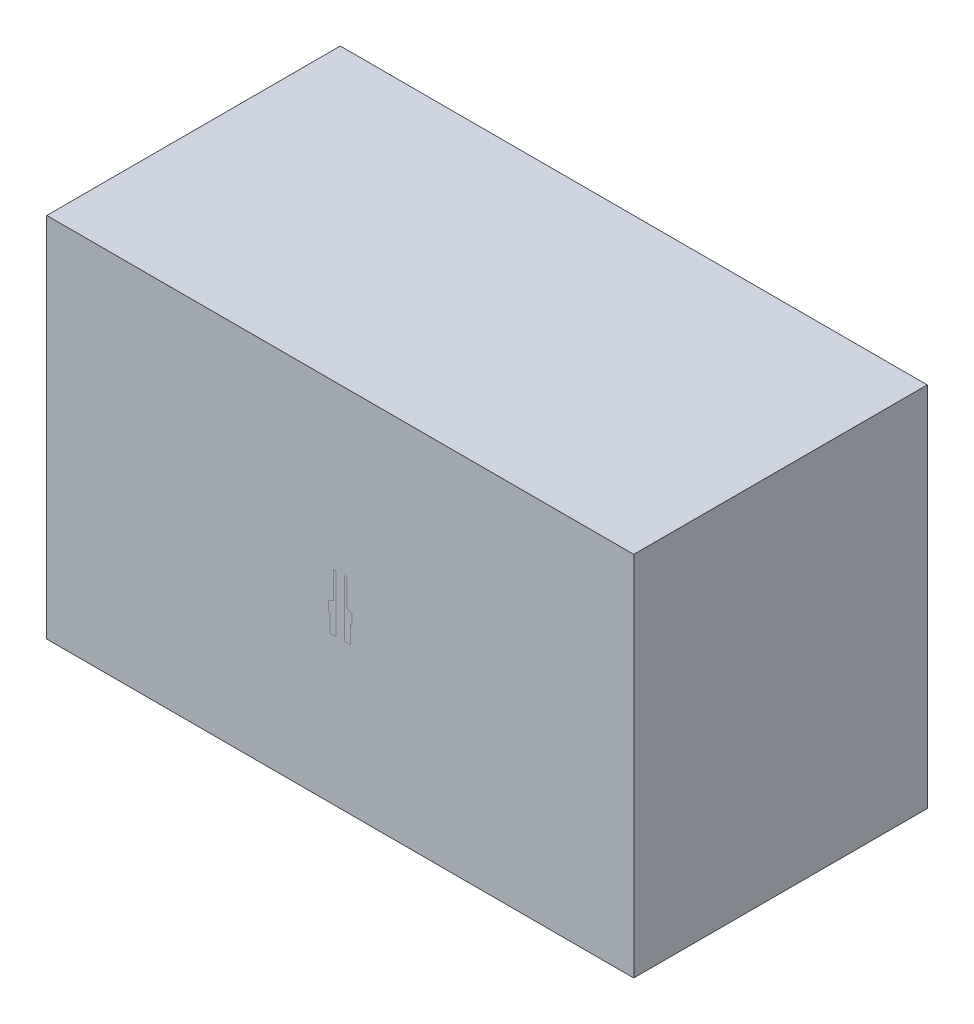
ISO-10303-21;
HEADER;
FILE_DESCRIPTION(('STEP AP214'),'2;1');
FILE_NAME('part.step','',(''),(''),'','','');
FILE_SCHEMA(('AUTOMOTIVE_DESIGN { 1 0 10303 214 1 1 1 1 }'));
ENDSEC;
DATA;
#1=APPLICATION_CONTEXT('core data for automotive mechanical design processes');
#2=APPLICATION_PROTOCOL_DEFINITION('international standard','automotive_design',2000,#1);
#3=PRODUCT_CONTEXT('',#1,'mechanical');
#4=PRODUCT('Part','Part','',(#3));
#5=PRODUCT_RELATED_PRODUCT_CATEGORY('part','',(#4));
#6=PRODUCT_DEFINITION_FORMATION('','',#4);
#7=PRODUCT_DEFINITION_CONTEXT('part definition',#1,'design');
#8=PRODUCT_DEFINITION('design','',#6,#7);
#9=PRODUCT_DEFINITION_SHAPE('','',#8);
#10=(LENGTH_UNIT() NAMED_UNIT(*) SI_UNIT(.MILLI.,.METRE.));
#11=(NAMED_UNIT(*) PLANE_ANGLE_UNIT() SI_UNIT($,.RADIAN.));
#12=(NAMED_UNIT(*) SI_UNIT($,.STERADIAN.) SOLID_ANGLE_UNIT());
#13=UNCERTAINTY_MEASURE_WITH_UNIT(LENGTH_MEASURE(1.E-05),#10,'distance_accuracy_value','');
#14=(GEOMETRIC_REPRESENTATION_CONTEXT(3) GLOBAL_UNCERTAINTY_ASSIGNED_CONTEXT((#13)) GLOBAL_UNIT_ASSIGNED_CONTEXT((#10,
#11,#12)) REPRESENTATION_CONTEXT('',''));
#15=CARTESIAN_POINT('',(0.,0.,0.));
#16=DIRECTION('',(0.,0.,1.));
#17=DIRECTION('',(1.,0.,0.));
#18=AXIS2_PLACEMENT_3D('',#15,#16,#17);
#19=CARTESIAN_POINT('',(-74.9999999999963,990.4,0.));
#20=DIRECTION('',(0.,-1.,0.));
#21=DIRECTION('',(0.,0.,-1.));
#22=AXIS2_PLACEMENT_3D('',#19,#20,#21);
#23=PLANE('',#22);
#24=DIRECTION('',(-1.,0.,0.));
#25=VECTOR('',#24,1.);
#26=CARTESIAN_POINT('',(-74.9999999999963,990.4,0.));
#27=LINE('',#26,#25);
#28=CARTESIAN_POINT('',(113.099999999998,990.4,0.));
#29=VERTEX_POINT('',#28);
#30=CARTESIAN_POINT('',(75.,990.4,0.));
#31=VERTEX_POINT('',#30);
#32=EDGE_CURVE('E136',#29,#31,#27,.T.);
#33=ORIENTED_EDGE('',*,*,#32,.F.);
#34=CARTESIAN_POINT('',(0.,990.4,0.));
#35=DIRECTION('',(0.,-1.,0.));
#36=DIRECTION('',(0.,0.,-1.));
#37=AXIS2_PLACEMENT_3D('',#34,#35,#36);
#38=CIRCLE('',#37,113.099999999996);
#39=CARTESIAN_POINT('',(-113.099999999998,990.4,0.));
#40=VERTEX_POINT('',#39);
#41=EDGE_CURVE('E147',#40,#29,#38,.T.);
#42=ORIENTED_EDGE('',*,*,#41,.F.);
#43=CARTESIAN_POINT('',(-75.,990.4,0.));
#44=VERTEX_POINT('',#43);
#45=EDGE_CURVE('E130',#44,#40,#27,.T.);
#46=ORIENTED_EDGE('',*,*,#45,.F.);
#47=CARTESIAN_POINT('',(0.,990.4,0.));
#48=DIRECTION('',(0.,-1.,0.));
#49=DIRECTION('',(0.,0.,-1.));
#50=AXIS2_PLACEMENT_3D('',#47,#48,#49);
#51=CIRCLE('',#50,74.9999999999963);
#52=EDGE_CURVE('E118',#44,#31,#51,.T.);
#53=ORIENTED_EDGE('',*,*,#52,.T.);
#54=EDGE_LOOP('',(#33,#42,#46,#53));
#55=FACE_BOUND('',#54,.T.);
#56=ADVANCED_FACE('F49',(#55),#23,.F.);
#57=CARTESIAN_POINT('',(0.,0.,0.));
#58=DIRECTION('',(0.,-1.,0.));
#59=DIRECTION('',(0.,0.,-1.));
#60=AXIS2_PLACEMENT_3D('',#57,#58,#59);
#61=CYLINDRICAL_SURFACE('',#60,113.099999999998);
#62=DIRECTION('',(0.,-1.,0.));
#63=VECTOR('',#62,1.);
#64=CARTESIAN_POINT('',(-113.099999999998,0.,0.));
#65=LINE('',#64,#63);
#66=CARTESIAN_POINT('',(-113.099999999999,523.108658556931,0.));
#67=VERTEX_POINT('',#66);
#68=EDGE_CURVE('E134',#40,#67,#65,.T.);
#69=ORIENTED_EDGE('',*,*,#68,.F.);
#70=ORIENTED_EDGE('',*,*,#41,.T.);
#71=DIRECTION('',(0.,-1.,0.));
#72=VECTOR('',#71,1.);
#73=CARTESIAN_POINT('',(113.099999999998,0.,0.));
#74=LINE('',#73,#72);
#75=CARTESIAN_POINT('',(113.099999999999,523.108658556931,0.));
#76=VERTEX_POINT('',#75);
#77=EDGE_CURVE('E161',#76,#29,#74,.F.);
#78=ORIENTED_EDGE('',*,*,#77,.F.);
#79=CARTESIAN_POINT('',(0.,523.108658556931,0.));
#80=DIRECTION('',(0.,-1.,0.));
#81=DIRECTION('',(0.,0.,-1.));
#82=AXIS2_PLACEMENT_3D('',#79,#80,#81);
#83=CIRCLE('',#82,113.099999999999);
#84=EDGE_CURVE('E144',#67,#76,#83,.T.);
#85=ORIENTED_EDGE('',*,*,#84,.F.);
#86=EDGE_LOOP('',(#69,#70,#78,#85));
#87=FACE_BOUND('',#86,.T.);
#88=ADVANCED_FACE('F185',(#87),#61,.T.);
#89=CARTESIAN_POINT('',(0.,523.108658556931,0.));
#90=DIRECTION('',(0.,-1.,0.));
#91=DIRECTION('',(0.,0.,-1.));
#92=AXIS2_PLACEMENT_3D('',#89,#90,#91);
#93=CONICAL_SURFACE('',#92,113.099999999999,1.13446401379632);
#94=DIRECTION('',(-0.906307787036653,-0.422618261740693,0.));
#95=VECTOR('',#94,1.);
#96=CARTESIAN_POINT('',(0.,575.84805469426,0.));
#97=LINE('',#96,#95);
#98=CARTESIAN_POINT('',(-200.4,482.4,0.));
#99=VERTEX_POINT('',#98);
#100=EDGE_CURVE('E153',#67,#99,#97,.T.);
#101=ORIENTED_EDGE('',*,*,#100,.F.);
#102=ORIENTED_EDGE('',*,*,#84,.T.);
#103=DIRECTION('',(-0.906307787036653,0.422618261740693,0.));
#104=VECTOR('',#103,1.);
#105=CARTESIAN_POINT('',(0.,575.84805469426,0.));
#106=LINE('',#105,#104);
#107=CARTESIAN_POINT('',(200.4,482.4,0.));
#108=VERTEX_POINT('',#107);
#109=EDGE_CURVE('E163',#108,#76,#106,.T.);
#110=ORIENTED_EDGE('',*,*,#109,.F.);
#111=CARTESIAN_POINT('',(0.,482.4,0.));
#112=DIRECTION('',(0.,-1.,0.));
#113=DIRECTION('',(0.,0.,-1.));
#114=AXIS2_PLACEMENT_3D('',#111,#112,#113);
#115=CIRCLE('',#114,200.4);
#116=EDGE_CURVE('E141',#99,#108,#115,.T.);
#117=ORIENTED_EDGE('',*,*,#116,.F.);
#118=EDGE_LOOP('',(#101,#102,#110,#117));
#119=FACE_BOUND('',#118,.T.);
#120=ADVANCED_FACE('F191',(#119),#93,.T.);
#121=CARTESIAN_POINT('',(0.,0.,0.));
#122=DIRECTION('',(0.,-1.,0.));
#123=DIRECTION('',(0.,0.,-1.));
#124=AXIS2_PLACEMENT_3D('',#121,#122,#123);
#125=CYLINDRICAL_SURFACE('',#124,200.4);
#126=DIRECTION('',(0.,-1.,0.));
#127=VECTOR('',#126,1.);
#128=CARTESIAN_POINT('',(-200.4,0.,0.));
#129=LINE('',#128,#127);
#130=CARTESIAN_POINT('',(-200.4,307.,0.));
#131=VERTEX_POINT('',#130);
#132=EDGE_CURVE('E155',#99,#131,#129,.T.);
#133=ORIENTED_EDGE('',*,*,#132,.F.);
#134=ORIENTED_EDGE('',*,*,#116,.T.);
#135=DIRECTION('',(0.,-1.,0.));
#136=VECTOR('',#135,1.);
#137=CARTESIAN_POINT('',(200.4,0.,0.));
#138=LINE('',#137,#136);
#139=CARTESIAN_POINT('',(200.4,307.,0.));
#140=VERTEX_POINT('',#139);
#141=EDGE_CURVE('E125',#140,#108,#138,.F.);
#142=ORIENTED_EDGE('',*,*,#141,.F.);
#143=CARTESIAN_POINT('',(0.,307.,0.));
#144=DIRECTION('',(0.,-1.,0.));
#145=DIRECTION('',(0.,0.,-1.));
#146=AXIS2_PLACEMENT_3D('',#143,#144,#145);
#147=CIRCLE('',#146,200.4);
#148=EDGE_CURVE('E124',#131,#140,#147,.T.);
#149=ORIENTED_EDGE('',*,*,#148,.F.);
#150=EDGE_LOOP('',(#133,#134,#142,#149));
#151=FACE_BOUND('',#150,.T.);
#152=ADVANCED_FACE('F199',(#151),#125,.T.);
#153=CARTESIAN_POINT('',(-175.,307.,0.));
#154=DIRECTION('',(0.,1.,0.));
#155=DIRECTION('',(0.,0.,1.));
#156=AXIS2_PLACEMENT_3D('',#153,#154,#155);
#157=PLANE('',#156);
#158=DIRECTION('',(1.,0.,0.));
#159=VECTOR('',#158,1.);
#160=CARTESIAN_POINT('',(-175.,307.,0.));
#161=LINE('',#160,#159);
#162=CARTESIAN_POINT('',(-175.,307.,0.));
#163=VERTEX_POINT('',#162);
#164=EDGE_CURVE('E71',#131,#163,#161,.T.);
#165=ORIENTED_EDGE('',*,*,#164,.F.);
#166=ORIENTED_EDGE('',*,*,#148,.T.);
#167=CARTESIAN_POINT('',(175.,307.,0.));
#168=VERTEX_POINT('',#167);
#169=EDGE_CURVE('E112',#168,#140,#161,.T.);
#170=ORIENTED_EDGE('',*,*,#169,.F.);
#171=CARTESIAN_POINT('',(0.,307.,0.));
#172=DIRECTION('',(0.,1.,0.));
#173=DIRECTION('',(0.,0.,1.));
#174=AXIS2_PLACEMENT_3D('',#171,#172,#173);
#175=CIRCLE('',#174,175.);
#176=EDGE_CURVE('E122',#168,#163,#175,.T.);
#177=ORIENTED_EDGE('',*,*,#176,.T.);
#178=EDGE_LOOP('',(#165,#166,#170,#177));
#179=FACE_BOUND('',#178,.T.);
#180=ADVANCED_FACE('F51',(#179),#157,.F.);
#181=CARTESIAN_POINT('',(0.,457.,0.));
#182=DIRECTION('',(0.,-1.,0.));
#183=DIRECTION('',(0.,0.,-1.));
#184=AXIS2_PLACEMENT_3D('',#181,#182,#183);
#185=CYLINDRICAL_SURFACE('',#184,75.);
#186=ORIENTED_EDGE('',*,*,#52,.F.);
#187=DIRECTION('',(0.,-1.,0.));
#188=VECTOR('',#187,1.);
#189=CARTESIAN_POINT('',(-75.,457.,0.));
#190=LINE('',#189,#188);
#191=CARTESIAN_POINT('',(-75.,0.,0.));
#192=VERTEX_POINT('',#191);
#193=EDGE_CURVE('E157',#44,#192,#190,.T.);
#194=ORIENTED_EDGE('',*,*,#193,.T.);
#195=CARTESIAN_POINT('',(0.,0.,0.));
#196=DIRECTION('',(0.,1.,0.));
#197=DIRECTION('',(0.,0.,1.));
#198=AXIS2_PLACEMENT_3D('',#195,#196,#197);
#199=CIRCLE('',#198,75.);
#200=CARTESIAN_POINT('',(75.,0.,0.));
#201=VERTEX_POINT('',#200);
#202=EDGE_CURVE('E132',#201,#192,#199,.T.);
#203=ORIENTED_EDGE('',*,*,#202,.F.);
#204=DIRECTION('',(0.,-1.,0.));
#205=VECTOR('',#204,1.);
#206=CARTESIAN_POINT('',(75.,457.,0.));
#207=LINE('',#206,#205);
#208=EDGE_CURVE('E126',#201,#31,#207,.F.);
#209=ORIENTED_EDGE('',*,*,#208,.T.);
#210=EDGE_LOOP('',(#186,#194,#203,#209));
#211=FACE_BOUND('',#210,.T.);
#212=ADVANCED_FACE('F175',(#211),#185,.F.);
#213=CARTESIAN_POINT('',(0.,0.,0.));
#214=DIRECTION('',(0.,1.,0.));
#215=DIRECTION('',(0.,0.,1.));
#216=AXIS2_PLACEMENT_3D('',#213,#214,#215);
#217=PLANE('',#216);
#218=DIRECTION('',(1.,0.,0.));
#219=VECTOR('',#218,1.);
#220=CARTESIAN_POINT('',(0.,0.,0.));
#221=LINE('',#220,#219);
#222=CARTESIAN_POINT('',(-175.,0.,0.));
#223=VERTEX_POINT('',#222);
#224=EDGE_CURVE('E159',#223,#192,#221,.T.);
#225=ORIENTED_EDGE('',*,*,#224,.F.);
#226=CARTESIAN_POINT('',(0.,0.,0.));
#227=DIRECTION('',(0.,1.,0.));
#228=DIRECTION('',(0.,0.,1.));
#229=AXIS2_PLACEMENT_3D('',#226,#227,#228);
#230=CIRCLE('',#229,175.);
#231=CARTESIAN_POINT('',(175.,0.,0.));
#232=VERTEX_POINT('',#231);
#233=EDGE_CURVE('E129',#232,#223,#230,.T.);
#234=ORIENTED_EDGE('',*,*,#233,.F.);
#235=EDGE_CURVE('E64',#201,#232,#221,.T.);
#236=ORIENTED_EDGE('',*,*,#235,.F.);
#237=ORIENTED_EDGE('',*,*,#202,.T.);
#238=EDGE_LOOP('',(#225,#234,#236,#237));
#239=FACE_BOUND('',#238,.T.);
#240=ADVANCED_FACE('F176',(#239),#217,.F.);
#241=CARTESIAN_POINT('',(0.,457.,0.));
#242=DIRECTION('',(0.,-1.,0.));
#243=DIRECTION('',(0.,0.,-1.));
#244=AXIS2_PLACEMENT_3D('',#241,#242,#243);
#245=CYLINDRICAL_SURFACE('',#244,175.);
#246=DIRECTION('',(0.,-1.,0.));
#247=VECTOR('',#246,1.);
#248=CARTESIAN_POINT('',(-175.,457.,0.));
#249=LINE('',#248,#247);
#250=EDGE_CURVE('E12',#163,#223,#249,.T.);
#251=ORIENTED_EDGE('',*,*,#250,.F.);
#252=ORIENTED_EDGE('',*,*,#176,.F.);
#253=DIRECTION('',(0.,-1.,0.));
#254=VECTOR('',#253,1.);
#255=CARTESIAN_POINT('',(175.,457.,0.));
#256=LINE('',#255,#254);
#257=EDGE_CURVE('E57',#232,#168,#256,.F.);
#258=ORIENTED_EDGE('',*,*,#257,.F.);
#259=ORIENTED_EDGE('',*,*,#233,.T.);
#260=EDGE_LOOP('',(#251,#252,#258,#259));
#261=FACE_BOUND('',#260,.T.);
#262=ADVANCED_FACE('F128',(#261),#245,.T.);
#263=CARTESIAN_POINT('',(0.,0.,0.));
#264=DIRECTION('',(0.,0.,1.));
#265=DIRECTION('',(1.,0.,0.));
#266=AXIS2_PLACEMENT_3D('',#263,#264,#265);
#267=PLANE('',#266);
#268=ORIENTED_EDGE('',*,*,#32,.T.);
#269=ORIENTED_EDGE('',*,*,#208,.F.);
#270=ORIENTED_EDGE('',*,*,#235,.T.);
#271=ORIENTED_EDGE('',*,*,#257,.T.);
#272=ORIENTED_EDGE('',*,*,#169,.T.);
#273=ORIENTED_EDGE('',*,*,#141,.T.);
#274=ORIENTED_EDGE('',*,*,#109,.T.);
#275=ORIENTED_EDGE('',*,*,#77,.T.);
#276=EDGE_LOOP('',(#268,#269,#270,#271,#272,#273,#274,#275));
#277=FACE_BOUND('',#276,.T.);
#278=ADVANCED_FACE('F111',(#277),#267,.T.);
#279=ORIENTED_EDGE('',*,*,#45,.T.);
#280=ORIENTED_EDGE('',*,*,#68,.T.);
#281=ORIENTED_EDGE('',*,*,#100,.T.);
#282=ORIENTED_EDGE('',*,*,#132,.T.);
#283=ORIENTED_EDGE('',*,*,#164,.T.);
#284=ORIENTED_EDGE('',*,*,#250,.T.);
#285=ORIENTED_EDGE('',*,*,#224,.T.);
#286=ORIENTED_EDGE('',*,*,#193,.F.);
#287=EDGE_LOOP('',(#279,#280,#281,#282,#283,#284,#285,#286));
#288=FACE_BOUND('',#287,.T.);
#289=ADVANCED_FACE('F169',(#288),#267,.T.);
#290=CLOSED_SHELL('',(#56,#88,#120,#152,#180,#212,#240,#262,#278,#289));
#291=MANIFOLD_SOLID_BREP('B2',#290);
#292=CARTESIAN_POINT('',(5080.,-2540.,5080.));
#293=DIRECTION('',(0.,1.,0.));
#294=DIRECTION('',(0.,0.,1.));
#295=AXIS2_PLACEMENT_3D('',#292,#293,#294);
#296=PLANE('',#295);
#297=DIRECTION('',(1.,0.,0.));
#298=VECTOR('',#297,1.);
#299=CARTESIAN_POINT('',(5080.,-2540.,0.));
#300=LINE('',#299,#298);
#301=CARTESIAN_POINT('',(-5080.,-2540.,0.));
#302=VERTEX_POINT('',#301);
#303=CARTESIAN_POINT('',(5080.,-2540.,0.));
#304=VERTEX_POINT('',#303);
#305=EDGE_CURVE('E447',#302,#304,#300,.T.);
#306=ORIENTED_EDGE('',*,*,#305,.F.);
#307=DIRECTION('',(0.,0.,-1.));
#308=VECTOR('',#307,1.);
#309=CARTESIAN_POINT('',(-5080.,-2540.,5080.));
#310=LINE('',#309,#308);
#311=CARTESIAN_POINT('',(-5080.,-2540.,-5080.));
#312=VERTEX_POINT('',#311);
#313=EDGE_CURVE('E432',#302,#312,#310,.T.);
#314=ORIENTED_EDGE('',*,*,#313,.T.);
#315=DIRECTION('',(-1.,0.,0.));
#316=VECTOR('',#315,1.);
#317=CARTESIAN_POINT('',(5080.,-2540.,-5080.));
#318=LINE('',#317,#316);
#319=CARTESIAN_POINT('',(5080.,-2540.,-5080.));
#320=VERTEX_POINT('',#319);
#321=EDGE_CURVE('E395',#320,#312,#318,.T.);
#322=ORIENTED_EDGE('',*,*,#321,.F.);
#323=DIRECTION('',(0.,0.,-1.));
#324=VECTOR('',#323,1.);
#325=CARTESIAN_POINT('',(5080.,-2540.,5080.));
#326=LINE('',#325,#324);
#327=EDGE_CURVE('E428',#304,#320,#326,.T.);
#328=ORIENTED_EDGE('',*,*,#327,.F.);
#329=EDGE_LOOP('',(#306,#314,#322,#328));
#330=FACE_BOUND('',#329,.T.);
#331=ADVANCED_FACE('F279',(#330),#296,.F.);
#332=CARTESIAN_POINT('',(5080.,3810.00000000001,5080.));
#333=DIRECTION('',(0.,-1.,0.));
#334=DIRECTION('',(0.,0.,-1.));
#335=AXIS2_PLACEMENT_3D('',#332,#333,#334);
#336=PLANE('',#335);
#337=DIRECTION('',(-1.,0.,0.));
#338=VECTOR('',#337,1.);
#339=CARTESIAN_POINT('',(5080.,3810.,0.));
#340=LINE('',#339,#338);
#341=CARTESIAN_POINT('',(5080.,3810.,0.));
#342=VERTEX_POINT('',#341);
#343=CARTESIAN_POINT('',(-5080.,3810.,1.77635683940025E-12));
#344=VERTEX_POINT('',#343);
#345=EDGE_CURVE('E295',#342,#344,#340,.T.);
#346=ORIENTED_EDGE('',*,*,#345,.F.);
#347=DIRECTION('',(0.,0.,1.));
#348=VECTOR('',#347,1.);
#349=CARTESIAN_POINT('',(5080.,3810.00000000001,5080.));
#350=LINE('',#349,#348);
#351=CARTESIAN_POINT('',(5080.,3810.,-5080.));
#352=VERTEX_POINT('',#351);
#353=EDGE_CURVE('E423',#352,#342,#350,.T.);
#354=ORIENTED_EDGE('',*,*,#353,.F.);
#355=DIRECTION('',(-1.,0.,0.));
#356=VECTOR('',#355,1.);
#357=CARTESIAN_POINT('',(5080.,3810.,-5080.));
#358=LINE('',#357,#356);
#359=CARTESIAN_POINT('',(-5080.,3810.,-5080.));
#360=VERTEX_POINT('',#359);
#361=EDGE_CURVE('E419',#352,#360,#358,.T.);
#362=ORIENTED_EDGE('',*,*,#361,.T.);
#363=DIRECTION('',(0.,0.,1.));
#364=VECTOR('',#363,1.);
#365=CARTESIAN_POINT('',(-5080.,3810.00000000001,5080.));
#366=LINE('',#365,#364);
#367=EDGE_CURVE('E424',#360,#344,#366,.T.);
#368=ORIENTED_EDGE('',*,*,#367,.T.);
#369=EDGE_LOOP('',(#346,#354,#362,#368));
#370=FACE_BOUND('',#369,.T.);
#371=ADVANCED_FACE('F524',(#370),#336,.F.);
#372=CARTESIAN_POINT('',(5080.,0.,0.));
#373=DIRECTION('',(1.,0.,0.));
#374=DIRECTION('',(0.,0.,-1.));
#375=AXIS2_PLACEMENT_3D('',#372,#373,#374);
#376=PLANE('',#375);
#377=ORIENTED_EDGE('',*,*,#353,.T.);
#378=DIRECTION('',(0.,-1.,0.));
#379=VECTOR('',#378,1.);
#380=CARTESIAN_POINT('',(5080.,0.,0.));
#381=LINE('',#380,#379);
#382=EDGE_CURVE('E435',#342,#304,#381,.T.);
#383=ORIENTED_EDGE('',*,*,#382,.T.);
#384=ORIENTED_EDGE('',*,*,#327,.T.);
#385=DIRECTION('',(0.,1.,0.));
#386=VECTOR('',#385,1.);
#387=CARTESIAN_POINT('',(5080.,3810.,-5080.));
#388=LINE('',#387,#386);
#389=EDGE_CURVE('E439',#320,#352,#388,.T.);
#390=ORIENTED_EDGE('',*,*,#389,.T.);
#391=EDGE_LOOP('',(#377,#383,#384,#390));
#392=FACE_BOUND('',#391,.T.);
#393=ADVANCED_FACE('F530',(#392),#376,.T.);
#394=CARTESIAN_POINT('',(-5080.,0.,0.));
#395=DIRECTION('',(1.,0.,0.));
#396=DIRECTION('',(0.,0.,-1.));
#397=AXIS2_PLACEMENT_3D('',#394,#395,#396);
#398=PLANE('',#397);
#399=DIRECTION('',(0.,-1.,0.));
#400=VECTOR('',#399,1.);
#401=CARTESIAN_POINT('',(-5080.,0.,0.));
#402=LINE('',#401,#400);
#403=EDGE_CURVE('E452',#344,#302,#402,.T.);
#404=ORIENTED_EDGE('',*,*,#403,.F.);
#405=ORIENTED_EDGE('',*,*,#367,.F.);
#406=DIRECTION('',(0.,1.,0.));
#407=VECTOR('',#406,1.);
#408=CARTESIAN_POINT('',(-5080.,3810.,-5080.));
#409=LINE('',#408,#407);
#410=EDGE_CURVE('E429',#312,#360,#409,.T.);
#411=ORIENTED_EDGE('',*,*,#410,.F.);
#412=ORIENTED_EDGE('',*,*,#313,.F.);
#413=EDGE_LOOP('',(#404,#405,#411,#412));
#414=FACE_BOUND('',#413,.T.);
#415=ADVANCED_FACE('F583',(#414),#398,.F.);
#416=CARTESIAN_POINT('',(5080.,3810.,-5080.));
#417=DIRECTION('',(0.,0.,1.));
#418=DIRECTION('',(0.,-1.,0.));
#419=AXIS2_PLACEMENT_3D('',#416,#417,#418);
#420=PLANE('',#419);
#421=ORIENTED_EDGE('',*,*,#410,.T.);
#422=ORIENTED_EDGE('',*,*,#361,.F.);
#423=ORIENTED_EDGE('',*,*,#389,.F.);
#424=ORIENTED_EDGE('',*,*,#321,.T.);
#425=EDGE_LOOP('',(#421,#422,#423,#424));
#426=FACE_BOUND('',#425,.T.);
#427=ADVANCED_FACE('F536',(#426),#420,.F.);
#428=CARTESIAN_POINT('',(0.,0.,0.));
#429=DIRECTION('',(0.,0.,1.));
#430=DIRECTION('',(1.,0.,0.));
#431=AXIS2_PLACEMENT_3D('',#428,#429,#430);
#432=PLANE('',#431);
#433=ORIENTED_EDGE('',*,*,#345,.T.);
#434=ORIENTED_EDGE('',*,*,#403,.T.);
#435=ORIENTED_EDGE('',*,*,#305,.T.);
#436=ORIENTED_EDGE('',*,*,#382,.F.);
#437=EDGE_LOOP('',(#433,#434,#435,#436));
#438=FACE_BOUND('',#437,.T.);
#439=DIRECTION('',(0.,-1.,0.));
#440=VECTOR('',#439,1.);
#441=CARTESIAN_POINT('',(-75.,457.,0.));
#442=LINE('',#441,#440);
#443=CARTESIAN_POINT('',(-75.,990.4,0.));
#444=VERTEX_POINT('',#443);
#445=CARTESIAN_POINT('',(-75.,0.,0.));
#446=VERTEX_POINT('',#445);
#447=EDGE_CURVE('E469',#444,#446,#442,.T.);
#448=ORIENTED_EDGE('',*,*,#447,.T.);
#449=DIRECTION('',(1.,0.,0.));
#450=VECTOR('',#449,1.);
#451=CARTESIAN_POINT('',(0.,0.,0.));
#452=LINE('',#451,#450);
#453=CARTESIAN_POINT('',(-175.,0.,0.));
#454=VERTEX_POINT('',#453);
#455=EDGE_CURVE('E387',#454,#446,#452,.T.);
#456=ORIENTED_EDGE('',*,*,#455,.F.);
#457=DIRECTION('',(0.,-1.,0.));
#458=VECTOR('',#457,1.);
#459=CARTESIAN_POINT('',(-175.,457.,0.));
#460=LINE('',#459,#458);
#461=CARTESIAN_POINT('',(-175.,307.,0.));
#462=VERTEX_POINT('',#461);
#463=EDGE_CURVE('E47',#462,#454,#460,.T.);
#464=ORIENTED_EDGE('',*,*,#463,.F.);
#465=DIRECTION('',(1.,0.,0.));
#466=VECTOR('',#465,1.);
#467=CARTESIAN_POINT('',(-175.,307.,0.));
#468=LINE('',#467,#466);
#469=CARTESIAN_POINT('',(-200.4,307.,0.));
#470=VERTEX_POINT('',#469);
#471=EDGE_CURVE('E468',#470,#462,#468,.T.);
#472=ORIENTED_EDGE('',*,*,#471,.F.);
#473=DIRECTION('',(0.,-1.,0.));
#474=VECTOR('',#473,1.);
#475=CARTESIAN_POINT('',(-200.4,0.,0.));
#476=LINE('',#475,#474);
#477=CARTESIAN_POINT('',(-200.4,482.4,0.));
#478=VERTEX_POINT('',#477);
#479=EDGE_CURVE('E464',#478,#470,#476,.T.);
#480=ORIENTED_EDGE('',*,*,#479,.F.);
#481=DIRECTION('',(-0.906307787036653,-0.422618261740693,0.));
#482=VECTOR('',#481,1.);
#483=CARTESIAN_POINT('',(0.,575.84805469426,0.));
#484=LINE('',#483,#482);
#485=CARTESIAN_POINT('',(-113.099999999999,523.108658556931,0.));
#486=VERTEX_POINT('',#485);
#487=EDGE_CURVE('E460',#486,#478,#484,.T.);
#488=ORIENTED_EDGE('',*,*,#487,.F.);
#489=DIRECTION('',(0.,-1.,0.));
#490=VECTOR('',#489,1.);
#491=CARTESIAN_POINT('',(-113.099999999998,0.,0.));
#492=LINE('',#491,#490);
#493=CARTESIAN_POINT('',(-113.099999999998,990.4,0.));
#494=VERTEX_POINT('',#493);
#495=EDGE_CURVE('E456',#494,#486,#492,.T.);
#496=ORIENTED_EDGE('',*,*,#495,.F.);
#497=DIRECTION('',(-1.,0.,0.));
#498=VECTOR('',#497,1.);
#499=CARTESIAN_POINT('',(-74.9999999999963,990.4,0.));
#500=LINE('',#499,#498);
#501=EDGE_CURVE('E455',#444,#494,#500,.T.);
#502=ORIENTED_EDGE('',*,*,#501,.F.);
#503=EDGE_LOOP('',(#448,#456,#464,#472,#480,#488,#496,#502));
#504=FACE_BOUND('',#503,.T.);
#505=DIRECTION('',(0.,-1.,0.));
#506=VECTOR('',#505,1.);
#507=CARTESIAN_POINT('',(113.099999999998,0.,0.));
#508=LINE('',#507,#506);
#509=CARTESIAN_POINT('',(113.099999999999,523.108658556931,0.));
#510=VERTEX_POINT('',#509);
#511=CARTESIAN_POINT('',(113.099999999998,990.4,0.));
#512=VERTEX_POINT('',#511);
#513=EDGE_CURVE('E476',#510,#512,#508,.F.);
#514=ORIENTED_EDGE('',*,*,#513,.F.);
#515=DIRECTION('',(-0.906307787036653,0.422618261740693,0.));
#516=VECTOR('',#515,1.);
#517=CARTESIAN_POINT('',(0.,575.84805469426,0.));
#518=LINE('',#517,#516);
#519=CARTESIAN_POINT('',(200.4,482.4,0.));
#520=VERTEX_POINT('',#519);
#521=EDGE_CURVE('E480',#520,#510,#518,.T.);
#522=ORIENTED_EDGE('',*,*,#521,.F.);
#523=DIRECTION('',(0.,-1.,0.));
#524=VECTOR('',#523,1.);
#525=CARTESIAN_POINT('',(200.4,0.,0.));
#526=LINE('',#525,#524);
#527=CARTESIAN_POINT('',(200.4,307.,0.));
#528=VERTEX_POINT('',#527);
#529=EDGE_CURVE('E484',#528,#520,#526,.F.);
#530=ORIENTED_EDGE('',*,*,#529,.F.);
#531=CARTESIAN_POINT('',(175.,307.,0.));
#532=VERTEX_POINT('',#531);
#533=EDGE_CURVE('E303',#532,#528,#468,.T.);
#534=ORIENTED_EDGE('',*,*,#533,.F.);
#535=DIRECTION('',(0.,-1.,0.));
#536=VECTOR('',#535,1.);
#537=CARTESIAN_POINT('',(175.,457.,0.));
#538=LINE('',#537,#536);
#539=CARTESIAN_POINT('',(175.,0.,0.));
#540=VERTEX_POINT('',#539);
#541=EDGE_CURVE('E288',#540,#532,#538,.F.);
#542=ORIENTED_EDGE('',*,*,#541,.F.);
#543=CARTESIAN_POINT('',(75.,0.,0.));
#544=VERTEX_POINT('',#543);
#545=EDGE_CURVE('E368',#544,#540,#452,.T.);
#546=ORIENTED_EDGE('',*,*,#545,.F.);
#547=DIRECTION('',(0.,-1.,0.));
#548=VECTOR('',#547,1.);
#549=CARTESIAN_POINT('',(75.,457.,0.));
#550=LINE('',#549,#548);
#551=CARTESIAN_POINT('',(75.,990.4,0.));
#552=VERTEX_POINT('',#551);
#553=EDGE_CURVE('E385',#544,#552,#550,.F.);
#554=ORIENTED_EDGE('',*,*,#553,.T.);
#555=EDGE_CURVE('E472',#512,#552,#500,.T.);
#556=ORIENTED_EDGE('',*,*,#555,.F.);
#557=EDGE_LOOP('',(#514,#522,#530,#534,#542,#546,#554,#556));
#558=FACE_BOUND('',#557,.T.);
#559=ADVANCED_FACE('F367',(#438,#504,#558),#432,.T.);
#560=CARTESIAN_POINT('',(-74.9999999999963,990.4,0.));
#561=DIRECTION('',(0.,-1.,0.));
#562=DIRECTION('',(0.,0.,-1.));
#563=AXIS2_PLACEMENT_3D('',#560,#561,#562);
#564=PLANE('',#563);
#565=CARTESIAN_POINT('',(0.,990.4,0.));
#566=DIRECTION('',(0.,-1.,0.));
#567=DIRECTION('',(0.,0.,-1.));
#568=AXIS2_PLACEMENT_3D('',#565,#566,#567);
#569=CIRCLE('',#568,113.099999999996);
#570=EDGE_CURVE('E409',#494,#512,#569,.T.);
#571=ORIENTED_EDGE('',*,*,#570,.T.);
#572=ORIENTED_EDGE('',*,*,#555,.T.);
#573=CARTESIAN_POINT('',(0.,990.4,0.));
#574=DIRECTION('',(0.,-1.,0.));
#575=DIRECTION('',(0.,0.,-1.));
#576=AXIS2_PLACEMENT_3D('',#573,#574,#575);
#577=CIRCLE('',#576,74.9999999999963);
#578=EDGE_CURVE('E375',#444,#552,#577,.T.);
#579=ORIENTED_EDGE('',*,*,#578,.F.);
#580=ORIENTED_EDGE('',*,*,#501,.T.);
#581=EDGE_LOOP('',(#571,#572,#579,#580));
#582=FACE_BOUND('',#581,.T.);
#583=ADVANCED_FACE('F494',(#582),#564,.T.);
#584=CARTESIAN_POINT('',(0.,0.,0.));
#585=DIRECTION('',(0.,-1.,0.));
#586=DIRECTION('',(0.,0.,-1.));
#587=AXIS2_PLACEMENT_3D('',#584,#585,#586);
#588=CYLINDRICAL_SURFACE('',#587,113.099999999998);
#589=ORIENTED_EDGE('',*,*,#570,.F.);
#590=ORIENTED_EDGE('',*,*,#495,.T.);
#591=CARTESIAN_POINT('',(0.,523.108658556931,0.));
#592=DIRECTION('',(0.,-1.,0.));
#593=DIRECTION('',(0.,0.,-1.));
#594=AXIS2_PLACEMENT_3D('',#591,#592,#593);
#595=CIRCLE('',#594,113.099999999999);
#596=EDGE_CURVE('E405',#486,#510,#595,.T.);
#597=ORIENTED_EDGE('',*,*,#596,.T.);
#598=ORIENTED_EDGE('',*,*,#513,.T.);
#599=EDGE_LOOP('',(#589,#590,#597,#598));
#600=FACE_BOUND('',#599,.T.);
#601=ADVANCED_FACE('F505',(#600),#588,.F.);
#602=CARTESIAN_POINT('',(0.,523.108658556931,0.));
#603=DIRECTION('',(0.,-1.,0.));
#604=DIRECTION('',(0.,0.,-1.));
#605=AXIS2_PLACEMENT_3D('',#602,#603,#604);
#606=CONICAL_SURFACE('',#605,113.099999999999,1.13446401379632);
#607=ORIENTED_EDGE('',*,*,#596,.F.);
#608=ORIENTED_EDGE('',*,*,#487,.T.);
#609=CARTESIAN_POINT('',(0.,482.4,0.));
#610=DIRECTION('',(0.,-1.,0.));
#611=DIRECTION('',(0.,0.,-1.));
#612=AXIS2_PLACEMENT_3D('',#609,#610,#611);
#613=CIRCLE('',#612,200.4);
#614=EDGE_CURVE('E401',#478,#520,#613,.T.);
#615=ORIENTED_EDGE('',*,*,#614,.T.);
#616=ORIENTED_EDGE('',*,*,#521,.T.);
#617=EDGE_LOOP('',(#607,#608,#615,#616));
#618=FACE_BOUND('',#617,.T.);
#619=ADVANCED_FACE('F508',(#618),#606,.F.);
#620=CARTESIAN_POINT('',(0.,0.,0.));
#621=DIRECTION('',(0.,-1.,0.));
#622=DIRECTION('',(0.,0.,-1.));
#623=AXIS2_PLACEMENT_3D('',#620,#621,#622);
#624=CYLINDRICAL_SURFACE('',#623,200.4);
#625=ORIENTED_EDGE('',*,*,#614,.F.);
#626=ORIENTED_EDGE('',*,*,#479,.T.);
#627=CARTESIAN_POINT('',(0.,307.,0.));
#628=DIRECTION('',(0.,-1.,0.));
#629=DIRECTION('',(0.,0.,-1.));
#630=AXIS2_PLACEMENT_3D('',#627,#628,#629);
#631=CIRCLE('',#630,200.4);
#632=EDGE_CURVE('E393',#470,#528,#631,.T.);
#633=ORIENTED_EDGE('',*,*,#632,.T.);
#634=ORIENTED_EDGE('',*,*,#529,.T.);
#635=EDGE_LOOP('',(#625,#626,#633,#634));
#636=FACE_BOUND('',#635,.T.);
#637=ADVANCED_FACE('F511',(#636),#624,.F.);
#638=CARTESIAN_POINT('',(-175.,307.,0.));
#639=DIRECTION('',(0.,1.,0.));
#640=DIRECTION('',(0.,0.,1.));
#641=AXIS2_PLACEMENT_3D('',#638,#639,#640);
#642=PLANE('',#641);
#643=ORIENTED_EDGE('',*,*,#632,.F.);
#644=ORIENTED_EDGE('',*,*,#471,.T.);
#645=CARTESIAN_POINT('',(0.,307.,0.));
#646=DIRECTION('',(0.,1.,0.));
#647=DIRECTION('',(0.,0.,1.));
#648=AXIS2_PLACEMENT_3D('',#645,#646,#647);
#649=CIRCLE('',#648,175.);
#650=EDGE_CURVE('E389',#532,#462,#649,.T.);
#651=ORIENTED_EDGE('',*,*,#650,.F.);
#652=ORIENTED_EDGE('',*,*,#533,.T.);
#653=EDGE_LOOP('',(#643,#644,#651,#652));
#654=FACE_BOUND('',#653,.T.);
#655=ADVANCED_FACE('F514',(#654),#642,.T.);
#656=CARTESIAN_POINT('',(0.,457.,0.));
#657=DIRECTION('',(0.,-1.,0.));
#658=DIRECTION('',(0.,0.,-1.));
#659=AXIS2_PLACEMENT_3D('',#656,#657,#658);
#660=CYLINDRICAL_SURFACE('',#659,75.);
#661=ORIENTED_EDGE('',*,*,#447,.F.);
#662=ORIENTED_EDGE('',*,*,#578,.T.);
#663=ORIENTED_EDGE('',*,*,#553,.F.);
#664=CARTESIAN_POINT('',(0.,0.,0.));
#665=DIRECTION('',(0.,1.,0.));
#666=DIRECTION('',(0.,0.,1.));
#667=AXIS2_PLACEMENT_3D('',#664,#665,#666);
#668=CIRCLE('',#667,75.);
#669=EDGE_CURVE('E383',#544,#446,#668,.T.);
#670=ORIENTED_EDGE('',*,*,#669,.T.);
#671=EDGE_LOOP('',(#661,#662,#663,#670));
#672=FACE_BOUND('',#671,.T.);
#673=ADVANCED_FACE('F498',(#672),#660,.T.);
#674=CARTESIAN_POINT('',(0.,0.,0.));
#675=DIRECTION('',(0.,1.,0.));
#676=DIRECTION('',(0.,0.,1.));
#677=AXIS2_PLACEMENT_3D('',#674,#675,#676);
#678=PLANE('',#677);
#679=CARTESIAN_POINT('',(0.,0.,0.));
#680=DIRECTION('',(0.,1.,0.));
#681=DIRECTION('',(0.,0.,1.));
#682=AXIS2_PLACEMENT_3D('',#679,#680,#681);
#683=CIRCLE('',#682,175.);
#684=EDGE_CURVE('E381',#540,#454,#683,.T.);
#685=ORIENTED_EDGE('',*,*,#684,.T.);
#686=ORIENTED_EDGE('',*,*,#455,.T.);
#687=ORIENTED_EDGE('',*,*,#669,.F.);
#688=ORIENTED_EDGE('',*,*,#545,.T.);
#689=EDGE_LOOP('',(#685,#686,#687,#688));
#690=FACE_BOUND('',#689,.T.);
#691=ADVANCED_FACE('F379',(#690),#678,.T.);
#692=CARTESIAN_POINT('',(0.,457.,0.));
#693=DIRECTION('',(0.,-1.,0.));
#694=DIRECTION('',(0.,0.,-1.));
#695=AXIS2_PLACEMENT_3D('',#692,#693,#694);
#696=CYLINDRICAL_SURFACE('',#695,175.);
#697=ORIENTED_EDGE('',*,*,#650,.T.);
#698=ORIENTED_EDGE('',*,*,#463,.T.);
#699=ORIENTED_EDGE('',*,*,#684,.F.);
#700=ORIENTED_EDGE('',*,*,#541,.T.);
#701=EDGE_LOOP('',(#697,#698,#699,#700));
#702=FACE_BOUND('',#701,.T.);
#703=ADVANCED_FACE('F281',(#702),#696,.F.);
#704=CLOSED_SHELL('',(#331,#371,#393,#415,#427,#559,#583,#601,#619,#637,#655,#673,#691,#703));
#705=MANIFOLD_SOLID_BREP('B6',#704);
#706=ADVANCED_BREP_SHAPE_REPRESENTATION('',(#18,#291,#705),#14);
#707=SHAPE_DEFINITION_REPRESENTATION(#9,#706);
ENDSEC;
END-ISO-10303-21;
